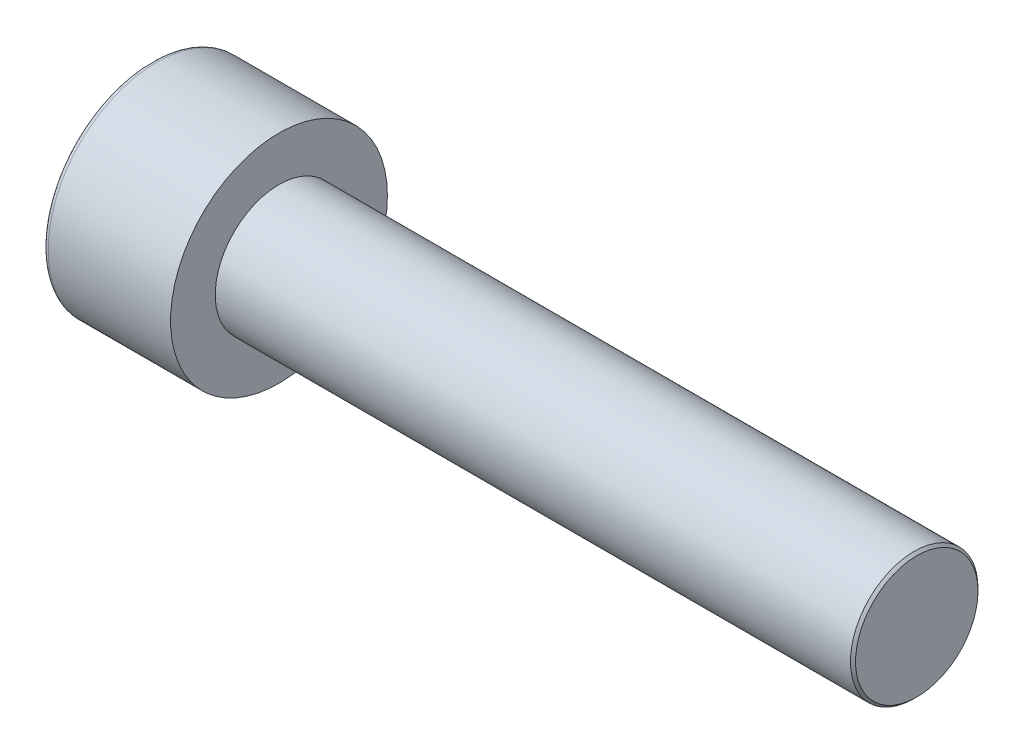
ISO-10303-21;
HEADER;
FILE_DESCRIPTION(('STEP AP214'),'2;1');
FILE_NAME('part.step','',(''),(''),'','','');
FILE_SCHEMA(('AUTOMOTIVE_DESIGN { 1 0 10303 214 1 1 1 1 }'));
ENDSEC;
DATA;
#1=APPLICATION_CONTEXT('core data for automotive mechanical design processes');
#2=APPLICATION_PROTOCOL_DEFINITION('international standard','automotive_design',2000,#1);
#3=PRODUCT_CONTEXT('',#1,'mechanical');
#4=PRODUCT('Part','Part','',(#3));
#5=PRODUCT_RELATED_PRODUCT_CATEGORY('part','',(#4));
#6=PRODUCT_DEFINITION_FORMATION('','',#4);
#7=PRODUCT_DEFINITION_CONTEXT('part definition',#1,'design');
#8=PRODUCT_DEFINITION('design','',#6,#7);
#9=PRODUCT_DEFINITION_SHAPE('','',#8);
#10=(LENGTH_UNIT() NAMED_UNIT(*) SI_UNIT(.MILLI.,.METRE.));
#11=(NAMED_UNIT(*) PLANE_ANGLE_UNIT() SI_UNIT($,.RADIAN.));
#12=(NAMED_UNIT(*) SI_UNIT($,.STERADIAN.) SOLID_ANGLE_UNIT());
#13=UNCERTAINTY_MEASURE_WITH_UNIT(LENGTH_MEASURE(1.E-05),#10,'distance_accuracy_value','');
#14=(GEOMETRIC_REPRESENTATION_CONTEXT(3) GLOBAL_UNCERTAINTY_ASSIGNED_CONTEXT((#13)) GLOBAL_UNIT_ASSIGNED_CONTEXT((#10,
#11,#12)) REPRESENTATION_CONTEXT('',''));
#15=CARTESIAN_POINT('',(0.,0.,0.));
#16=DIRECTION('',(0.,0.,1.));
#17=DIRECTION('',(1.,0.,0.));
#18=AXIS2_PLACEMENT_3D('',#15,#16,#17);
#19=CARTESIAN_POINT('',(2.5,0.,-2.3094010767585));
#20=DIRECTION('',(1.,0.,0.));
#21=DIRECTION('',(0.,0.,-1.));
#22=AXIS2_PLACEMENT_3D('',#19,#20,#21);
#23=PLANE('',#22);
#24=CARTESIAN_POINT('',(2.5,0.,0.));
#25=DIRECTION('',(1.,0.,0.));
#26=DIRECTION('',(0.,0.,-1.));
#27=AXIS2_PLACEMENT_3D('',#24,#25,#26);
#28=CIRCLE('',#27,2.);
#29=CARTESIAN_POINT('',(2.5,-1.,-1.73205080756888));
#30=VERTEX_POINT('',#29);
#31=CARTESIAN_POINT('',(2.5,-2.,0.));
#32=VERTEX_POINT('',#31);
#33=EDGE_CURVE('E159',#30,#32,#28,.F.);
#34=ORIENTED_EDGE('',*,*,#33,.F.);
#35=DIRECTION('',(0.,0.866025403784439,-0.5));
#36=VECTOR('',#35,1.);
#37=CARTESIAN_POINT('',(2.5,-2.,-1.15470053837925));
#38=LINE('',#37,#36);
#39=CARTESIAN_POINT('',(2.5,-2.,-1.15470053837925));
#40=VERTEX_POINT('',#39);
#41=EDGE_CURVE('E167',#40,#30,#38,.T.);
#42=ORIENTED_EDGE('',*,*,#41,.F.);
#43=DIRECTION('',(0.,0.,-1.));
#44=VECTOR('',#43,1.);
#45=CARTESIAN_POINT('',(2.5,-2.,1.15470053837925));
#46=LINE('',#45,#44);
#47=EDGE_CURVE('E184',#32,#40,#46,.T.);
#48=ORIENTED_EDGE('',*,*,#47,.F.);
#49=EDGE_LOOP('',(#34,#42,#48));
#50=FACE_BOUND('',#49,.T.);
#51=ADVANCED_FACE('F36',(#50),#23,.F.);
#52=CARTESIAN_POINT('',(2.5,-1.,1.73205080756888));
#53=VERTEX_POINT('',#52);
#54=EDGE_CURVE('E289',#32,#53,#28,.F.);
#55=ORIENTED_EDGE('',*,*,#54,.F.);
#56=CARTESIAN_POINT('',(2.5,-2.,1.15470053837925));
#57=VERTEX_POINT('',#56);
#58=EDGE_CURVE('E185',#57,#32,#46,.T.);
#59=ORIENTED_EDGE('',*,*,#58,.F.);
#60=DIRECTION('',(0.,-0.866025403784439,-0.5));
#61=VECTOR('',#60,1.);
#62=CARTESIAN_POINT('',(2.5,0.,2.3094010767585));
#63=LINE('',#62,#61);
#64=EDGE_CURVE('E180',#53,#57,#63,.T.);
#65=ORIENTED_EDGE('',*,*,#64,.F.);
#66=EDGE_LOOP('',(#55,#59,#65));
#67=FACE_BOUND('',#66,.T.);
#68=ADVANCED_FACE('F125',(#67),#23,.F.);
#69=CARTESIAN_POINT('',(2.5,1.,1.73205080756888));
#70=VERTEX_POINT('',#69);
#71=EDGE_CURVE('E285',#53,#70,#28,.F.);
#72=ORIENTED_EDGE('',*,*,#71,.F.);
#73=CARTESIAN_POINT('',(2.5,0.,2.3094010767585));
#74=VERTEX_POINT('',#73);
#75=EDGE_CURVE('E181',#74,#53,#63,.T.);
#76=ORIENTED_EDGE('',*,*,#75,.F.);
#77=DIRECTION('',(0.,-0.866025403784439,0.5));
#78=VECTOR('',#77,1.);
#79=CARTESIAN_POINT('',(2.5,2.,1.15470053837925));
#80=LINE('',#79,#78);
#81=EDGE_CURVE('E176',#70,#74,#80,.T.);
#82=ORIENTED_EDGE('',*,*,#81,.F.);
#83=EDGE_LOOP('',(#72,#76,#82));
#84=FACE_BOUND('',#83,.T.);
#85=ADVANCED_FACE('F131',(#84),#23,.F.);
#86=CARTESIAN_POINT('',(2.5,2.,0.));
#87=VERTEX_POINT('',#86);
#88=EDGE_CURVE('E156',#70,#87,#28,.F.);
#89=ORIENTED_EDGE('',*,*,#88,.F.);
#90=CARTESIAN_POINT('',(2.5,2.,1.15470053837925));
#91=VERTEX_POINT('',#90);
#92=EDGE_CURVE('E177',#91,#70,#80,.T.);
#93=ORIENTED_EDGE('',*,*,#92,.F.);
#94=DIRECTION('',(0.,0.,1.));
#95=VECTOR('',#94,1.);
#96=CARTESIAN_POINT('',(2.5,2.,-1.15470053837925));
#97=LINE('',#96,#95);
#98=EDGE_CURVE('E171',#87,#91,#97,.T.);
#99=ORIENTED_EDGE('',*,*,#98,.F.);
#100=EDGE_LOOP('',(#89,#93,#99));
#101=FACE_BOUND('',#100,.T.);
#102=ADVANCED_FACE('F145',(#101),#23,.F.);
#103=CARTESIAN_POINT('',(2.5,0.,0.));
#104=DIRECTION('',(1.,0.,0.));
#105=DIRECTION('',(0.,0.,-1.));
#106=AXIS2_PLACEMENT_3D('',#103,#104,#105);
#107=CIRCLE('',#106,2.);
#108=CARTESIAN_POINT('',(2.5,1.,-1.73205080756888));
#109=VERTEX_POINT('',#108);
#110=EDGE_CURVE('E51',#109,#87,#107,.T.);
#111=ORIENTED_EDGE('',*,*,#110,.T.);
#112=CARTESIAN_POINT('',(2.5,2.,-1.15470053837925));
#113=VERTEX_POINT('',#112);
#114=EDGE_CURVE('E164',#113,#87,#97,.T.);
#115=ORIENTED_EDGE('',*,*,#114,.F.);
#116=DIRECTION('',(0.,0.866025403784438,0.5));
#117=VECTOR('',#116,1.);
#118=CARTESIAN_POINT('',(2.5,0.,-2.3094010767585));
#119=LINE('',#118,#117);
#120=EDGE_CURVE('E161',#109,#113,#119,.T.);
#121=ORIENTED_EDGE('',*,*,#120,.F.);
#122=EDGE_LOOP('',(#111,#115,#121));
#123=FACE_BOUND('',#122,.T.);
#124=ADVANCED_FACE('F136',(#123),#23,.F.);
#125=EDGE_CURVE('E149',#109,#30,#28,.F.);
#126=ORIENTED_EDGE('',*,*,#125,.F.);
#127=CARTESIAN_POINT('',(2.5,0.,-2.3094010767585));
#128=VERTEX_POINT('',#127);
#129=EDGE_CURVE('E152',#128,#109,#119,.T.);
#130=ORIENTED_EDGE('',*,*,#129,.F.);
#131=EDGE_CURVE('E154',#30,#128,#38,.T.);
#132=ORIENTED_EDGE('',*,*,#131,.F.);
#133=EDGE_LOOP('',(#126,#130,#132));
#134=FACE_BOUND('',#133,.T.);
#135=ADVANCED_FACE('F127',(#134),#23,.F.);
#136=CARTESIAN_POINT('',(0.,0.,0.));
#137=DIRECTION('',(1.,0.,0.));
#138=DIRECTION('',(0.,0.,-1.));
#139=AXIS2_PLACEMENT_3D('',#136,#137,#138);
#140=PLANE('',#139);
#141=CARTESIAN_POINT('',(0.,0.,0.));
#142=DIRECTION('',(1.,0.,0.));
#143=DIRECTION('',(0.,0.,-1.));
#144=AXIS2_PLACEMENT_3D('',#141,#142,#143);
#145=CIRCLE('',#144,4.05);
#146=CARTESIAN_POINT('',(0.,0.,-4.05));
#147=VERTEX_POINT('',#146);
#148=EDGE_CURVE('E224',#147,#147,#145,.F.);
#149=ORIENTED_EDGE('',*,*,#148,.T.);
#150=EDGE_LOOP('',(#149));
#151=FACE_BOUND('',#150,.T.);
#152=DIRECTION('',(0.,0.866025403784439,-0.5));
#153=VECTOR('',#152,1.);
#154=CARTESIAN_POINT('',(0.,-2.,-1.15470053837925));
#155=LINE('',#154,#153);
#156=CARTESIAN_POINT('',(0.,-2.,-1.15470053837925));
#157=VERTEX_POINT('',#156);
#158=CARTESIAN_POINT('',(0.,0.,-2.3094010767585));
#159=VERTEX_POINT('',#158);
#160=EDGE_CURVE('E59',#157,#159,#155,.T.);
#161=ORIENTED_EDGE('',*,*,#160,.T.);
#162=DIRECTION('',(0.,0.866025403784438,0.5));
#163=VECTOR('',#162,1.);
#164=CARTESIAN_POINT('',(0.,0.,-2.3094010767585));
#165=LINE('',#164,#163);
#166=CARTESIAN_POINT('',(0.,2.,-1.15470053837925));
#167=VERTEX_POINT('',#166);
#168=EDGE_CURVE('E190',#159,#167,#165,.T.);
#169=ORIENTED_EDGE('',*,*,#168,.T.);
#170=DIRECTION('',(0.,0.,1.));
#171=VECTOR('',#170,1.);
#172=CARTESIAN_POINT('',(0.,2.,-1.15470053837925));
#173=LINE('',#172,#171);
#174=CARTESIAN_POINT('',(0.,2.,1.15470053837925));
#175=VERTEX_POINT('',#174);
#176=EDGE_CURVE('E193',#167,#175,#173,.T.);
#177=ORIENTED_EDGE('',*,*,#176,.T.);
#178=DIRECTION('',(0.,-0.866025403784439,0.5));
#179=VECTOR('',#178,1.);
#180=CARTESIAN_POINT('',(0.,2.,1.15470053837925));
#181=LINE('',#180,#179);
#182=CARTESIAN_POINT('',(0.,0.,2.3094010767585));
#183=VERTEX_POINT('',#182);
#184=EDGE_CURVE('E196',#175,#183,#181,.T.);
#185=ORIENTED_EDGE('',*,*,#184,.T.);
#186=DIRECTION('',(0.,-0.866025403784439,-0.5));
#187=VECTOR('',#186,1.);
#188=CARTESIAN_POINT('',(0.,0.,2.3094010767585));
#189=LINE('',#188,#187);
#190=CARTESIAN_POINT('',(0.,-2.,1.15470053837925));
#191=VERTEX_POINT('',#190);
#192=EDGE_CURVE('E199',#183,#191,#189,.T.);
#193=ORIENTED_EDGE('',*,*,#192,.T.);
#194=DIRECTION('',(0.,0.,-1.));
#195=VECTOR('',#194,1.);
#196=CARTESIAN_POINT('',(0.,-2.,1.15470053837925));
#197=LINE('',#196,#195);
#198=EDGE_CURVE('E202',#191,#157,#197,.T.);
#199=ORIENTED_EDGE('',*,*,#198,.T.);
#200=EDGE_LOOP('',(#161,#169,#177,#185,#193,#199));
#201=FACE_BOUND('',#200,.T.);
#202=ADVANCED_FACE('F135',(#151,#201),#140,.F.);
#203=CARTESIAN_POINT('',(5.,0.,0.));
#204=DIRECTION('',(1.,0.,0.));
#205=DIRECTION('',(0.,0.,-1.));
#206=AXIS2_PLACEMENT_3D('',#203,#204,#205);
#207=PLANE('',#206);
#208=CARTESIAN_POINT('',(5.,0.,0.));
#209=DIRECTION('',(1.,0.,0.));
#210=DIRECTION('',(0.,0.,-1.));
#211=AXIS2_PLACEMENT_3D('',#208,#209,#210);
#212=CIRCLE('',#211,4.25);
#213=CARTESIAN_POINT('',(5.,0.,-4.25));
#214=VERTEX_POINT('',#213);
#215=EDGE_CURVE('E157',#214,#214,#212,.T.);
#216=ORIENTED_EDGE('',*,*,#215,.T.);
#217=EDGE_LOOP('',(#216));
#218=FACE_BOUND('',#217,.T.);
#219=CARTESIAN_POINT('',(5.,0.,0.));
#220=DIRECTION('',(1.,0.,0.));
#221=DIRECTION('',(0.,0.,-1.));
#222=AXIS2_PLACEMENT_3D('',#219,#220,#221);
#223=CIRCLE('',#222,2.5);
#224=CARTESIAN_POINT('',(5.,0.,-2.5));
#225=VERTEX_POINT('',#224);
#226=EDGE_CURVE('E215',#225,#225,#223,.T.);
#227=ORIENTED_EDGE('',*,*,#226,.F.);
#228=EDGE_LOOP('',(#227));
#229=FACE_BOUND('',#228,.T.);
#230=ADVANCED_FACE('F142',(#218,#229),#207,.T.);
#231=CARTESIAN_POINT('',(5.,0.,0.));
#232=DIRECTION('',(-1.,0.,0.));
#233=DIRECTION('',(0.,0.,1.));
#234=AXIS2_PLACEMENT_3D('',#231,#232,#233);
#235=CYLINDRICAL_SURFACE('',#234,4.25);
#236=CARTESIAN_POINT('',(0.2,0.,0.));
#237=DIRECTION('',(1.,0.,0.));
#238=DIRECTION('',(0.,0.,-1.));
#239=AXIS2_PLACEMENT_3D('',#236,#237,#238);
#240=CIRCLE('',#239,4.25);
#241=CARTESIAN_POINT('',(0.2,0.,-4.25));
#242=VERTEX_POINT('',#241);
#243=EDGE_CURVE('E221',#242,#242,#240,.T.);
#244=ORIENTED_EDGE('',*,*,#243,.T.);
#245=EDGE_LOOP('',(#244));
#246=FACE_BOUND('',#245,.T.);
#247=ORIENTED_EDGE('',*,*,#215,.F.);
#248=EDGE_LOOP('',(#247));
#249=FACE_BOUND('',#248,.T.);
#250=ADVANCED_FACE('F240',(#246,#249),#235,.T.);
#251=CARTESIAN_POINT('',(30.,0.,0.));
#252=DIRECTION('',(-1.,0.,0.));
#253=DIRECTION('',(0.,0.,1.));
#254=AXIS2_PLACEMENT_3D('',#251,#252,#253);
#255=CYLINDRICAL_SURFACE('',#254,2.5);
#256=CARTESIAN_POINT('',(29.9,0.,0.));
#257=DIRECTION('',(1.,0.,0.));
#258=DIRECTION('',(0.,0.,-1.));
#259=AXIS2_PLACEMENT_3D('',#256,#257,#258);
#260=CIRCLE('',#259,2.5);
#261=CARTESIAN_POINT('',(29.9,0.,-2.5));
#262=VERTEX_POINT('',#261);
#263=EDGE_CURVE('E11',#262,#262,#260,.F.);
#264=ORIENTED_EDGE('',*,*,#263,.T.);
#265=EDGE_LOOP('',(#264));
#266=FACE_BOUND('',#265,.T.);
#267=ORIENTED_EDGE('',*,*,#226,.T.);
#268=EDGE_LOOP('',(#267));
#269=FACE_BOUND('',#268,.T.);
#270=ADVANCED_FACE('F237',(#266,#269),#255,.T.);
#271=CARTESIAN_POINT('',(30.,0.,0.));
#272=DIRECTION('',(1.,0.,0.));
#273=DIRECTION('',(0.,0.,-1.));
#274=AXIS2_PLACEMENT_3D('',#271,#272,#273);
#275=PLANE('',#274);
#276=CARTESIAN_POINT('',(30.,0.,0.));
#277=DIRECTION('',(1.,0.,0.));
#278=DIRECTION('',(0.,0.,-1.));
#279=AXIS2_PLACEMENT_3D('',#276,#277,#278);
#280=CIRCLE('',#279,2.4);
#281=CARTESIAN_POINT('',(30.,0.,-2.4));
#282=VERTEX_POINT('',#281);
#283=EDGE_CURVE('E44',#282,#282,#280,.T.);
#284=ORIENTED_EDGE('',*,*,#283,.T.);
#285=EDGE_LOOP('',(#284));
#286=FACE_BOUND('',#285,.T.);
#287=ADVANCED_FACE('F229',(#286),#275,.T.);
#288=CARTESIAN_POINT('',(2.5,-2.,-1.15470053837925));
#289=DIRECTION('',(0.,0.5,0.866025403784438));
#290=DIRECTION('',(0.,-0.866025403784439,0.5));
#291=AXIS2_PLACEMENT_3D('',#288,#289,#290);
#292=PLANE('',#291);
#293=ORIENTED_EDGE('',*,*,#160,.F.);
#294=DIRECTION('',(-1.,0.,0.));
#295=VECTOR('',#294,1.);
#296=CARTESIAN_POINT('',(2.5,-2.,-1.15470053837925));
#297=LINE('',#296,#295);
#298=EDGE_CURVE('E188',#40,#157,#297,.T.);
#299=ORIENTED_EDGE('',*,*,#298,.F.);
#300=ORIENTED_EDGE('',*,*,#41,.T.);
#301=ORIENTED_EDGE('',*,*,#131,.T.);
#302=DIRECTION('',(-1.,0.,0.));
#303=VECTOR('',#302,1.);
#304=CARTESIAN_POINT('',(2.5,0.,-2.3094010767585));
#305=LINE('',#304,#303);
#306=EDGE_CURVE('E170',#128,#159,#305,.T.);
#307=ORIENTED_EDGE('',*,*,#306,.T.);
#308=EDGE_LOOP('',(#293,#299,#300,#301,#307));
#309=FACE_BOUND('',#308,.T.);
#310=ADVANCED_FACE('F255',(#309),#292,.T.);
#311=CARTESIAN_POINT('',(2.5,0.,-2.3094010767585));
#312=DIRECTION('',(0.,-0.5,0.866025403784438));
#313=DIRECTION('',(0.,-0.866025403784439,-0.5));
#314=AXIS2_PLACEMENT_3D('',#311,#312,#313);
#315=PLANE('',#314);
#316=ORIENTED_EDGE('',*,*,#168,.F.);
#317=ORIENTED_EDGE('',*,*,#306,.F.);
#318=ORIENTED_EDGE('',*,*,#129,.T.);
#319=ORIENTED_EDGE('',*,*,#120,.T.);
#320=DIRECTION('',(-1.,0.,0.));
#321=VECTOR('',#320,1.);
#322=CARTESIAN_POINT('',(2.5,2.,-1.15470053837925));
#323=LINE('',#322,#321);
#324=EDGE_CURVE('E212',#113,#167,#323,.T.);
#325=ORIENTED_EDGE('',*,*,#324,.T.);
#326=EDGE_LOOP('',(#316,#317,#318,#319,#325));
#327=FACE_BOUND('',#326,.T.);
#328=ADVANCED_FACE('F169',(#327),#315,.T.);
#329=CARTESIAN_POINT('',(2.5,2.,-1.15470053837925));
#330=DIRECTION('',(0.,-1.,0.));
#331=DIRECTION('',(0.,0.,-1.));
#332=AXIS2_PLACEMENT_3D('',#329,#330,#331);
#333=PLANE('',#332);
#334=ORIENTED_EDGE('',*,*,#176,.F.);
#335=ORIENTED_EDGE('',*,*,#324,.F.);
#336=ORIENTED_EDGE('',*,*,#114,.T.);
#337=ORIENTED_EDGE('',*,*,#98,.T.);
#338=DIRECTION('',(-1.,0.,0.));
#339=VECTOR('',#338,1.);
#340=CARTESIAN_POINT('',(2.5,2.,1.15470053837925));
#341=LINE('',#340,#339);
#342=EDGE_CURVE('E210',#91,#175,#341,.T.);
#343=ORIENTED_EDGE('',*,*,#342,.T.);
#344=EDGE_LOOP('',(#334,#335,#336,#337,#343));
#345=FACE_BOUND('',#344,.T.);
#346=ADVANCED_FACE('F260',(#345),#333,.T.);
#347=CARTESIAN_POINT('',(2.5,2.,1.15470053837925));
#348=DIRECTION('',(0.,-0.5,-0.866025403784438));
#349=DIRECTION('',(0.,0.866025403784439,-0.5));
#350=AXIS2_PLACEMENT_3D('',#347,#348,#349);
#351=PLANE('',#350);
#352=ORIENTED_EDGE('',*,*,#184,.F.);
#353=ORIENTED_EDGE('',*,*,#342,.F.);
#354=ORIENTED_EDGE('',*,*,#92,.T.);
#355=ORIENTED_EDGE('',*,*,#81,.T.);
#356=DIRECTION('',(-1.,0.,0.));
#357=VECTOR('',#356,1.);
#358=CARTESIAN_POINT('',(2.5,0.,2.3094010767585));
#359=LINE('',#358,#357);
#360=EDGE_CURVE('E208',#74,#183,#359,.T.);
#361=ORIENTED_EDGE('',*,*,#360,.T.);
#362=EDGE_LOOP('',(#352,#353,#354,#355,#361));
#363=FACE_BOUND('',#362,.T.);
#364=ADVANCED_FACE('F263',(#363),#351,.T.);
#365=CARTESIAN_POINT('',(2.5,0.,2.3094010767585));
#366=DIRECTION('',(0.,0.5,-0.866025403784438));
#367=DIRECTION('',(0.,0.866025403784439,0.5));
#368=AXIS2_PLACEMENT_3D('',#365,#366,#367);
#369=PLANE('',#368);
#370=ORIENTED_EDGE('',*,*,#192,.F.);
#371=ORIENTED_EDGE('',*,*,#360,.F.);
#372=ORIENTED_EDGE('',*,*,#75,.T.);
#373=ORIENTED_EDGE('',*,*,#64,.T.);
#374=DIRECTION('',(-1.,0.,0.));
#375=VECTOR('',#374,1.);
#376=CARTESIAN_POINT('',(2.5,-2.,1.15470053837925));
#377=LINE('',#376,#375);
#378=EDGE_CURVE('E206',#57,#191,#377,.T.);
#379=ORIENTED_EDGE('',*,*,#378,.T.);
#380=EDGE_LOOP('',(#370,#371,#372,#373,#379));
#381=FACE_BOUND('',#380,.T.);
#382=ADVANCED_FACE('F120',(#381),#369,.T.);
#383=CARTESIAN_POINT('',(2.5,-2.,1.15470053837925));
#384=DIRECTION('',(0.,1.,0.));
#385=DIRECTION('',(0.,0.,1.));
#386=AXIS2_PLACEMENT_3D('',#383,#384,#385);
#387=PLANE('',#386);
#388=ORIENTED_EDGE('',*,*,#198,.F.);
#389=ORIENTED_EDGE('',*,*,#378,.F.);
#390=ORIENTED_EDGE('',*,*,#58,.T.);
#391=ORIENTED_EDGE('',*,*,#47,.T.);
#392=ORIENTED_EDGE('',*,*,#298,.T.);
#393=EDGE_LOOP('',(#388,#389,#390,#391,#392));
#394=FACE_BOUND('',#393,.T.);
#395=ADVANCED_FACE('F113',(#394),#387,.T.);
#396=CARTESIAN_POINT('',(2.5,0.,0.));
#397=DIRECTION('',(-1.,0.,0.));
#398=DIRECTION('',(0.,0.,1.));
#399=AXIS2_PLACEMENT_3D('',#396,#397,#398);
#400=CONICAL_SURFACE('',#399,2.,1.04719755119659);
#401=CARTESIAN_POINT('',(3.65470053837926,0.,0.));
#402=VERTEX_POINT('',#401);
#403=VERTEX_LOOP('',#402);
#404=FACE_BOUND('',#403,.T.);
#405=ORIENTED_EDGE('',*,*,#110,.F.);
#406=ORIENTED_EDGE('',*,*,#125,.T.);
#407=ORIENTED_EDGE('',*,*,#33,.T.);
#408=ORIENTED_EDGE('',*,*,#54,.T.);
#409=ORIENTED_EDGE('',*,*,#71,.T.);
#410=ORIENTED_EDGE('',*,*,#88,.T.);
#411=EDGE_LOOP('',(#405,#406,#407,#408,#409,#410));
#412=FACE_BOUND('',#411,.T.);
#413=ADVANCED_FACE('F110',(#404,#412),#400,.F.);
#414=CARTESIAN_POINT('',(0.2,0.,0.));
#415=DIRECTION('',(1.,0.,0.));
#416=DIRECTION('',(0.,0.,-1.));
#417=AXIS2_PLACEMENT_3D('',#414,#415,#416);
#418=TOROIDAL_SURFACE('',#417,4.05,0.2);
#419=ORIENTED_EDGE('',*,*,#148,.F.);
#420=EDGE_LOOP('',(#419));
#421=FACE_BOUND('',#420,.T.);
#422=ORIENTED_EDGE('',*,*,#243,.F.);
#423=EDGE_LOOP('',(#422));
#424=FACE_BOUND('',#423,.T.);
#425=ADVANCED_FACE('F112',(#421,#424),#418,.T.);
#426=CARTESIAN_POINT('',(30.,0.,0.));
#427=DIRECTION('',(-1.,0.,0.));
#428=DIRECTION('',(0.,0.,1.));
#429=AXIS2_PLACEMENT_3D('',#426,#427,#428);
#430=CONICAL_SURFACE('',#429,2.4,0.78539816339742);
#431=ORIENTED_EDGE('',*,*,#263,.F.);
#432=EDGE_LOOP('',(#431));
#433=FACE_BOUND('',#432,.T.);
#434=ORIENTED_EDGE('',*,*,#283,.F.);
#435=EDGE_LOOP('',(#434));
#436=FACE_BOUND('',#435,.T.);
#437=ADVANCED_FACE('F38',(#433,#436),#430,.T.);
#438=CLOSED_SHELL('',(#51,#68,#85,#102,#124,#135,#202,#230,#250,#270,#287,#310,#328,#346,#364,
#382,#395,#413,#425,#437));
#439=MANIFOLD_SOLID_BREP('B2',#438);
#440=ADVANCED_BREP_SHAPE_REPRESENTATION('',(#18,#439),#14);
#441=SHAPE_DEFINITION_REPRESENTATION(#9,#440);
ENDSEC;
END-ISO-10303-21;
